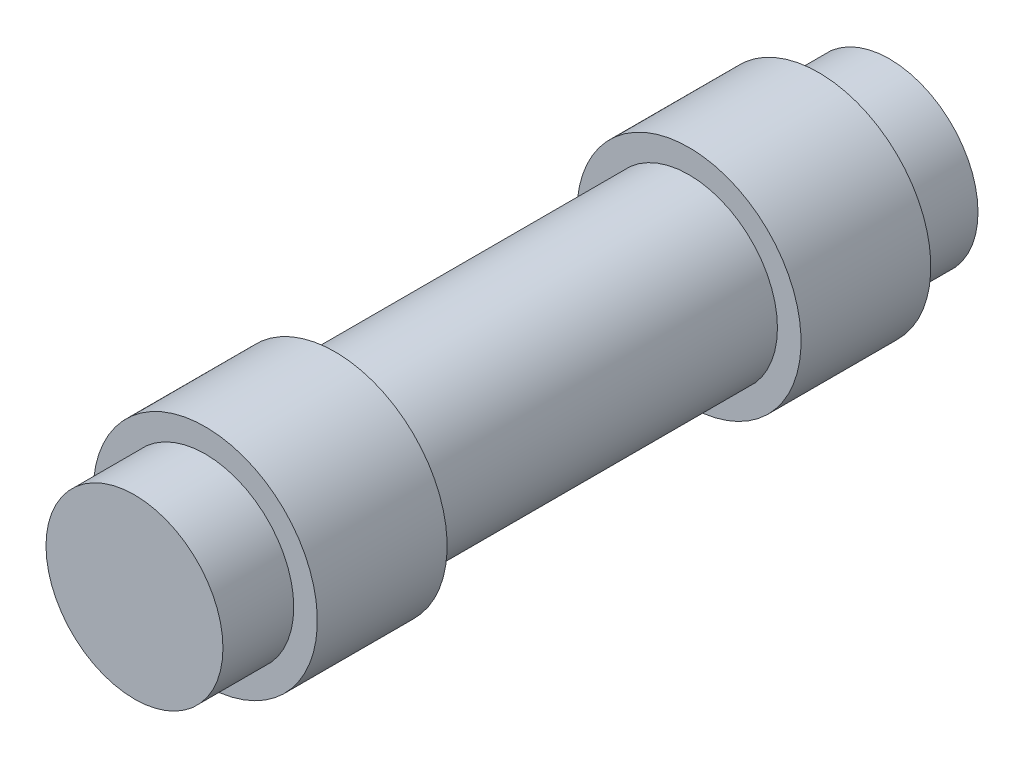
ISO-10303-21;
HEADER;
FILE_DESCRIPTION(('STEP AP214'),'2;1');
FILE_NAME('part.step','',(''),(''),'','','');
FILE_SCHEMA(('AUTOMOTIVE_DESIGN { 1 0 10303 214 1 1 1 1 }'));
ENDSEC;
DATA;
#1=APPLICATION_CONTEXT('core data for automotive mechanical design processes');
#2=APPLICATION_PROTOCOL_DEFINITION('international standard','automotive_design',2000,#1);
#3=PRODUCT_CONTEXT('',#1,'mechanical');
#4=PRODUCT('Part','Part','',(#3));
#5=PRODUCT_RELATED_PRODUCT_CATEGORY('part','',(#4));
#6=PRODUCT_DEFINITION_FORMATION('','',#4);
#7=PRODUCT_DEFINITION_CONTEXT('part definition',#1,'design');
#8=PRODUCT_DEFINITION('design','',#6,#7);
#9=PRODUCT_DEFINITION_SHAPE('','',#8);
#10=(LENGTH_UNIT() NAMED_UNIT(*) SI_UNIT(.MILLI.,.METRE.));
#11=(NAMED_UNIT(*) PLANE_ANGLE_UNIT() SI_UNIT($,.RADIAN.));
#12=(NAMED_UNIT(*) SI_UNIT($,.STERADIAN.) SOLID_ANGLE_UNIT());
#13=UNCERTAINTY_MEASURE_WITH_UNIT(LENGTH_MEASURE(1.E-05),#10,'distance_accuracy_value','');
#14=(GEOMETRIC_REPRESENTATION_CONTEXT(3) GLOBAL_UNCERTAINTY_ASSIGNED_CONTEXT((#13)) GLOBAL_UNIT_ASSIGNED_CONTEXT((#10,
#11,#12)) REPRESENTATION_CONTEXT('',''));
#15=CARTESIAN_POINT('',(0.,0.,0.));
#16=DIRECTION('',(0.,0.,1.));
#17=DIRECTION('',(1.,0.,0.));
#18=AXIS2_PLACEMENT_3D('',#15,#16,#17);
#19=CARTESIAN_POINT('',(0.,0.,32.));
#20=DIRECTION('',(0.,0.,-1.));
#21=DIRECTION('',(-1.,0.,0.));
#22=AXIS2_PLACEMENT_3D('',#19,#20,#21);
#23=CYLINDRICAL_SURFACE('',#22,3.75);
#24=CARTESIAN_POINT('',(0.,0.,32.));
#25=DIRECTION('',(0.,0.,1.));
#26=DIRECTION('',(1.,0.,0.));
#27=AXIS2_PLACEMENT_3D('',#24,#25,#26);
#28=CIRCLE('',#27,3.75);
#29=CARTESIAN_POINT('',(3.75,0.,32.));
#30=VERTEX_POINT('',#29);
#31=EDGE_CURVE('E47',#30,#30,#28,.T.);
#32=ORIENTED_EDGE('',*,*,#31,.F.);
#33=EDGE_LOOP('',(#32));
#34=FACE_BOUND('',#33,.T.);
#35=CARTESIAN_POINT('',(0.,0.,29.));
#36=DIRECTION('',(0.,0.,-1.));
#37=DIRECTION('',(-1.,0.,0.));
#38=AXIS2_PLACEMENT_3D('',#35,#36,#37);
#39=CIRCLE('',#38,3.75);
#40=CARTESIAN_POINT('',(-3.75,0.,29.));
#41=VERTEX_POINT('',#40);
#42=EDGE_CURVE('E10',#41,#41,#39,.T.);
#43=ORIENTED_EDGE('',*,*,#42,.F.);
#44=EDGE_LOOP('',(#43));
#45=FACE_BOUND('',#44,.T.);
#46=ADVANCED_FACE('F36',(#34,#45),#23,.T.);
#47=CARTESIAN_POINT('',(0.,0.,32.));
#48=DIRECTION('',(0.,0.,1.));
#49=DIRECTION('',(1.,0.,0.));
#50=AXIS2_PLACEMENT_3D('',#47,#48,#49);
#51=PLANE('',#50);
#52=ORIENTED_EDGE('',*,*,#31,.T.);
#53=EDGE_LOOP('',(#52));
#54=FACE_BOUND('',#53,.T.);
#55=ADVANCED_FACE('F93',(#54),#51,.T.);
#56=CARTESIAN_POINT('',(0.,0.,0.));
#57=DIRECTION('',(0.,0.,-1.));
#58=DIRECTION('',(-1.,0.,0.));
#59=AXIS2_PLACEMENT_3D('',#56,#57,#58);
#60=CYLINDRICAL_SURFACE('',#59,4.75);
#61=CARTESIAN_POINT('',(0.,0.,23.5));
#62=DIRECTION('',(0.,0.,-1.));
#63=DIRECTION('',(-1.,0.,0.));
#64=AXIS2_PLACEMENT_3D('',#61,#62,#63);
#65=CIRCLE('',#64,4.75);
#66=CARTESIAN_POINT('',(-4.75,0.,23.5));
#67=VERTEX_POINT('',#66);
#68=EDGE_CURVE('E69',#67,#67,#65,.T.);
#69=ORIENTED_EDGE('',*,*,#68,.F.);
#70=EDGE_LOOP('',(#69));
#71=FACE_BOUND('',#70,.T.);
#72=CARTESIAN_POINT('',(0.,0.,29.));
#73=DIRECTION('',(0.,0.,-1.));
#74=DIRECTION('',(-1.,0.,0.));
#75=AXIS2_PLACEMENT_3D('',#72,#73,#74);
#76=CIRCLE('',#75,4.75);
#77=CARTESIAN_POINT('',(-4.75,0.,29.));
#78=VERTEX_POINT('',#77);
#79=EDGE_CURVE('E55',#78,#78,#76,.T.);
#80=ORIENTED_EDGE('',*,*,#79,.T.);
#81=EDGE_LOOP('',(#80));
#82=FACE_BOUND('',#81,.T.);
#83=ADVANCED_FACE('F88',(#71,#82),#60,.T.);
#84=CARTESIAN_POINT('',(0.,0.,29.));
#85=DIRECTION('',(0.,0.,-1.));
#86=DIRECTION('',(-1.,0.,0.));
#87=AXIS2_PLACEMENT_3D('',#84,#85,#86);
#88=PLANE('',#87);
#89=ORIENTED_EDGE('',*,*,#79,.F.);
#90=EDGE_LOOP('',(#89));
#91=FACE_BOUND('',#90,.T.);
#92=ORIENTED_EDGE('',*,*,#42,.T.);
#93=EDGE_LOOP('',(#92));
#94=FACE_BOUND('',#93,.T.);
#95=ADVANCED_FACE('F80',(#91,#94),#88,.F.);
#96=CARTESIAN_POINT('',(0.,0.,23.5));
#97=DIRECTION('',(0.,0.,-1.));
#98=DIRECTION('',(-1.,0.,0.));
#99=AXIS2_PLACEMENT_3D('',#96,#97,#98);
#100=PLANE('',#99);
#101=ORIENTED_EDGE('',*,*,#68,.T.);
#102=EDGE_LOOP('',(#101));
#103=FACE_BOUND('',#102,.T.);
#104=CARTESIAN_POINT('',(0.,0.,23.5));
#105=DIRECTION('',(0.,0.,-1.));
#106=DIRECTION('',(-1.,0.,0.));
#107=AXIS2_PLACEMENT_3D('',#104,#105,#106);
#108=CIRCLE('',#107,3.75);
#109=CARTESIAN_POINT('',(-3.75,0.,23.5));
#110=VERTEX_POINT('',#109);
#111=EDGE_CURVE('E60',#110,#110,#108,.T.);
#112=ORIENTED_EDGE('',*,*,#111,.F.);
#113=EDGE_LOOP('',(#112));
#114=FACE_BOUND('',#113,.T.);
#115=ADVANCED_FACE('F78',(#103,#114),#100,.T.);
#116=ORIENTED_EDGE('',*,*,#111,.T.);
#117=EDGE_LOOP('',(#116));
#118=FACE_BOUND('',#117,.T.);
#119=CARTESIAN_POINT('',(0.,0.,8.5));
#120=DIRECTION('',(0.,0.,-1.));
#121=DIRECTION('',(-1.,0.,0.));
#122=AXIS2_PLACEMENT_3D('',#119,#120,#121);
#123=CIRCLE('',#122,3.75);
#124=CARTESIAN_POINT('',(-3.75,0.,8.5));
#125=VERTEX_POINT('',#124);
#126=EDGE_CURVE('E43',#125,#125,#123,.T.);
#127=ORIENTED_EDGE('',*,*,#126,.F.);
#128=EDGE_LOOP('',(#127));
#129=FACE_BOUND('',#128,.T.);
#130=ADVANCED_FACE('F75',(#118,#129),#23,.T.);
#131=CARTESIAN_POINT('',(0.,0.,3.));
#132=DIRECTION('',(0.,0.,-1.));
#133=DIRECTION('',(-1.,0.,0.));
#134=AXIS2_PLACEMENT_3D('',#131,#132,#133);
#135=PLANE('',#134);
#136=CARTESIAN_POINT('',(0.,0.,3.));
#137=DIRECTION('',(0.,0.,-1.));
#138=DIRECTION('',(-1.,0.,0.));
#139=AXIS2_PLACEMENT_3D('',#136,#137,#138);
#140=CIRCLE('',#139,4.75);
#141=CARTESIAN_POINT('',(-4.75,0.,3.));
#142=VERTEX_POINT('',#141);
#143=EDGE_CURVE('E57',#142,#142,#140,.T.);
#144=ORIENTED_EDGE('',*,*,#143,.T.);
#145=EDGE_LOOP('',(#144));
#146=FACE_BOUND('',#145,.T.);
#147=CARTESIAN_POINT('',(0.,0.,3.));
#148=DIRECTION('',(0.,0.,-1.));
#149=DIRECTION('',(-1.,0.,0.));
#150=AXIS2_PLACEMENT_3D('',#147,#148,#149);
#151=CIRCLE('',#150,3.75);
#152=CARTESIAN_POINT('',(-3.75,0.,3.));
#153=VERTEX_POINT('',#152);
#154=EDGE_CURVE('E61',#153,#153,#151,.T.);
#155=ORIENTED_EDGE('',*,*,#154,.F.);
#156=EDGE_LOOP('',(#155));
#157=FACE_BOUND('',#156,.T.);
#158=ADVANCED_FACE('F87',(#146,#157),#135,.T.);
#159=CARTESIAN_POINT('',(0.,0.,0.));
#160=DIRECTION('',(0.,0.,-1.));
#161=DIRECTION('',(-1.,0.,0.));
#162=AXIS2_PLACEMENT_3D('',#159,#160,#161);
#163=CYLINDRICAL_SURFACE('',#162,4.75);
#164=CARTESIAN_POINT('',(0.,0.,8.5));
#165=DIRECTION('',(0.,0.,-1.));
#166=DIRECTION('',(-1.,0.,0.));
#167=AXIS2_PLACEMENT_3D('',#164,#165,#166);
#168=CIRCLE('',#167,4.75);
#169=CARTESIAN_POINT('',(-4.75,0.,8.5));
#170=VERTEX_POINT('',#169);
#171=EDGE_CURVE('E64',#170,#170,#168,.T.);
#172=ORIENTED_EDGE('',*,*,#171,.T.);
#173=EDGE_LOOP('',(#172));
#174=FACE_BOUND('',#173,.T.);
#175=ORIENTED_EDGE('',*,*,#143,.F.);
#176=EDGE_LOOP('',(#175));
#177=FACE_BOUND('',#176,.T.);
#178=ADVANCED_FACE('F115',(#174,#177),#163,.T.);
#179=CARTESIAN_POINT('',(0.,0.,8.5));
#180=DIRECTION('',(0.,0.,-1.));
#181=DIRECTION('',(-1.,0.,0.));
#182=AXIS2_PLACEMENT_3D('',#179,#180,#181);
#183=PLANE('',#182);
#184=ORIENTED_EDGE('',*,*,#171,.F.);
#185=EDGE_LOOP('',(#184));
#186=FACE_BOUND('',#185,.T.);
#187=ORIENTED_EDGE('',*,*,#126,.T.);
#188=EDGE_LOOP('',(#187));
#189=FACE_BOUND('',#188,.T.);
#190=ADVANCED_FACE('F108',(#186,#189),#183,.F.);
#191=CARTESIAN_POINT('',(0.,0.,0.));
#192=DIRECTION('',(0.,0.,1.));
#193=DIRECTION('',(1.,0.,0.));
#194=AXIS2_PLACEMENT_3D('',#191,#192,#193);
#195=PLANE('',#194);
#196=CARTESIAN_POINT('',(0.,0.,0.));
#197=DIRECTION('',(0.,0.,1.));
#198=DIRECTION('',(1.,0.,0.));
#199=AXIS2_PLACEMENT_3D('',#196,#197,#198);
#200=CIRCLE('',#199,3.75);
#201=CARTESIAN_POINT('',(3.75,0.,0.));
#202=VERTEX_POINT('',#201);
#203=EDGE_CURVE('E51',#202,#202,#200,.T.);
#204=ORIENTED_EDGE('',*,*,#203,.F.);
#205=EDGE_LOOP('',(#204));
#206=FACE_BOUND('',#205,.T.);
#207=ADVANCED_FACE('F103',(#206),#195,.F.);
#208=ORIENTED_EDGE('',*,*,#154,.T.);
#209=EDGE_LOOP('',(#208));
#210=FACE_BOUND('',#209,.T.);
#211=ORIENTED_EDGE('',*,*,#203,.T.);
#212=EDGE_LOOP('',(#211));
#213=FACE_BOUND('',#212,.T.);
#214=ADVANCED_FACE('F38',(#210,#213),#23,.T.);
#215=CLOSED_SHELL('',(#46,#55,#83,#95,#115,#130,#158,#178,#190,#207,#214));
#216=MANIFOLD_SOLID_BREP('B2',#215);
#217=ADVANCED_BREP_SHAPE_REPRESENTATION('',(#18,#216),#14);
#218=SHAPE_DEFINITION_REPRESENTATION(#9,#217);
ENDSEC;
END-ISO-10303-21;
